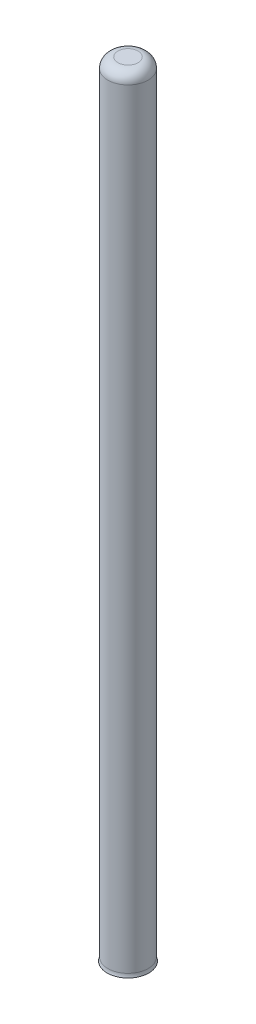
ISO-10303-21;
HEADER;
FILE_DESCRIPTION(('STEP AP214'),'2;1');
FILE_NAME('part.step','',(''),(''),'','','');
FILE_SCHEMA(('AUTOMOTIVE_DESIGN { 1 0 10303 214 1 1 1 1 }'));
ENDSEC;
DATA;
#1=APPLICATION_CONTEXT('core data for automotive mechanical design processes');
#2=APPLICATION_PROTOCOL_DEFINITION('international standard','automotive_design',2000,#1);
#3=PRODUCT_CONTEXT('',#1,'mechanical');
#4=PRODUCT('Part','Part','',(#3));
#5=PRODUCT_RELATED_PRODUCT_CATEGORY('part','',(#4));
#6=PRODUCT_DEFINITION_FORMATION('','',#4);
#7=PRODUCT_DEFINITION_CONTEXT('part definition',#1,'design');
#8=PRODUCT_DEFINITION('design','',#6,#7);
#9=PRODUCT_DEFINITION_SHAPE('','',#8);
#10=(LENGTH_UNIT() NAMED_UNIT(*) SI_UNIT(.MILLI.,.METRE.));
#11=(NAMED_UNIT(*) PLANE_ANGLE_UNIT() SI_UNIT($,.RADIAN.));
#12=(NAMED_UNIT(*) SI_UNIT($,.STERADIAN.) SOLID_ANGLE_UNIT());
#13=UNCERTAINTY_MEASURE_WITH_UNIT(LENGTH_MEASURE(1.E-05),#10,'distance_accuracy_value','');
#14=(GEOMETRIC_REPRESENTATION_CONTEXT(3) GLOBAL_UNCERTAINTY_ASSIGNED_CONTEXT((#13)) GLOBAL_UNIT_ASSIGNED_CONTEXT((#10,
#11,#12)) REPRESENTATION_CONTEXT('',''));
#15=CARTESIAN_POINT('',(0.,0.,0.));
#16=DIRECTION('',(0.,0.,1.));
#17=DIRECTION('',(1.,0.,0.));
#18=AXIS2_PLACEMENT_3D('',#15,#16,#17);
#19=CARTESIAN_POINT('',(0.,10.5086028255087,0.));
#20=DIRECTION('',(0.,-1.,0.));
#21=DIRECTION('',(0.,0.,-1.));
#22=AXIS2_PLACEMENT_3D('',#19,#20,#21);
#23=TOROIDAL_SURFACE('',#22,6.,2.);
#24=CARTESIAN_POINT('',(0.,10.5086028255087,0.));
#25=DIRECTION('',(0.,-1.,0.));
#26=DIRECTION('',(0.,0.,-1.));
#27=AXIS2_PLACEMENT_3D('',#24,#25,#26);
#28=CIRCLE('',#27,4.);
#29=CARTESIAN_POINT('',(0.,10.5086028255087,-4.));
#30=VERTEX_POINT('',#29);
#31=EDGE_CURVE('E53',#30,#30,#28,.F.);
#32=ORIENTED_EDGE('',*,*,#31,.F.);
#33=EDGE_LOOP('',(#32));
#34=FACE_BOUND('',#33,.T.);
#35=CARTESIAN_POINT('',(0.,9.8,0.));
#36=DIRECTION('',(0.,1.,0.));
#37=DIRECTION('',(0.,0.,1.));
#38=AXIS2_PLACEMENT_3D('',#35,#36,#37);
#39=CIRCLE('',#38,4.12973744204696);
#40=CARTESIAN_POINT('',(0.,9.8,4.12973744204696));
#41=VERTEX_POINT('',#40);
#42=EDGE_CURVE('E49',#41,#41,#39,.F.);
#43=ORIENTED_EDGE('',*,*,#42,.F.);
#44=EDGE_LOOP('',(#43));
#45=FACE_BOUND('',#44,.T.);
#46=ADVANCED_FACE('F45',(#34,#45),#23,.F.);
#47=CARTESIAN_POINT('',(0.,165.,0.));
#48=DIRECTION('',(0.,1.,0.));
#49=DIRECTION('',(0.,0.,1.));
#50=AXIS2_PLACEMENT_3D('',#47,#48,#49);
#51=PLANE('',#50);
#52=CARTESIAN_POINT('',(0.,165.,0.));
#53=DIRECTION('',(0.,1.,0.));
#54=DIRECTION('',(0.,0.,1.));
#55=AXIS2_PLACEMENT_3D('',#52,#53,#54);
#56=CIRCLE('',#55,2.);
#57=CARTESIAN_POINT('',(0.,165.,2.));
#58=VERTEX_POINT('',#57);
#59=EDGE_CURVE('E12',#58,#58,#56,.T.);
#60=ORIENTED_EDGE('',*,*,#59,.T.);
#61=EDGE_LOOP('',(#60));
#62=FACE_BOUND('',#61,.T.);
#63=ADVANCED_FACE('F69',(#62),#51,.T.);
#64=CARTESIAN_POINT('',(0.,165.,0.));
#65=DIRECTION('',(0.,-1.,0.));
#66=DIRECTION('',(0.,0.,-1.));
#67=AXIS2_PLACEMENT_3D('',#64,#65,#66);
#68=CYLINDRICAL_SURFACE('',#67,4.);
#69=ORIENTED_EDGE('',*,*,#31,.T.);
#70=EDGE_LOOP('',(#69));
#71=FACE_BOUND('',#70,.T.);
#72=CARTESIAN_POINT('',(0.,163.,0.));
#73=DIRECTION('',(0.,1.,0.));
#74=DIRECTION('',(0.,0.,1.));
#75=AXIS2_PLACEMENT_3D('',#72,#73,#74);
#76=CIRCLE('',#75,4.);
#77=CARTESIAN_POINT('',(0.,163.,4.));
#78=VERTEX_POINT('',#77);
#79=EDGE_CURVE('E57',#78,#78,#76,.F.);
#80=ORIENTED_EDGE('',*,*,#79,.T.);
#81=EDGE_LOOP('',(#80));
#82=FACE_BOUND('',#81,.T.);
#83=ADVANCED_FACE('F74',(#71,#82),#68,.T.);
#84=CARTESIAN_POINT('',(0.,163.,0.));
#85=DIRECTION('',(0.,1.,0.));
#86=DIRECTION('',(0.,0.,1.));
#87=AXIS2_PLACEMENT_3D('',#84,#85,#86);
#88=DEGENERATE_TOROIDAL_SURFACE('',#87,2.,2.,.T.);
#89=ORIENTED_EDGE('',*,*,#79,.F.);
#90=EDGE_LOOP('',(#89));
#91=FACE_BOUND('',#90,.T.);
#92=ORIENTED_EDGE('',*,*,#59,.F.);
#93=EDGE_LOOP('',(#92));
#94=FACE_BOUND('',#93,.T.);
#95=ADVANCED_FACE('F47',(#91,#94),#88,.T.);
#96=CARTESIAN_POINT('',(0.,9.8,0.));
#97=DIRECTION('',(0.,-1.,0.));
#98=DIRECTION('',(0.,0.,-1.));
#99=AXIS2_PLACEMENT_3D('',#96,#97,#98);
#100=PLANE('',#99);
#101=ORIENTED_EDGE('',*,*,#42,.T.);
#102=EDGE_LOOP('',(#101));
#103=FACE_BOUND('',#102,.T.);
#104=ADVANCED_FACE('F66',(#103),#100,.T.);
#105=CLOSED_SHELL('',(#46,#63,#83,#95,#104));
#106=MANIFOLD_SOLID_BREP('B2',#105);
#107=ADVANCED_BREP_SHAPE_REPRESENTATION('',(#18,#106),#14);
#108=SHAPE_DEFINITION_REPRESENTATION(#9,#107);
ENDSEC;
END-ISO-10303-21;
